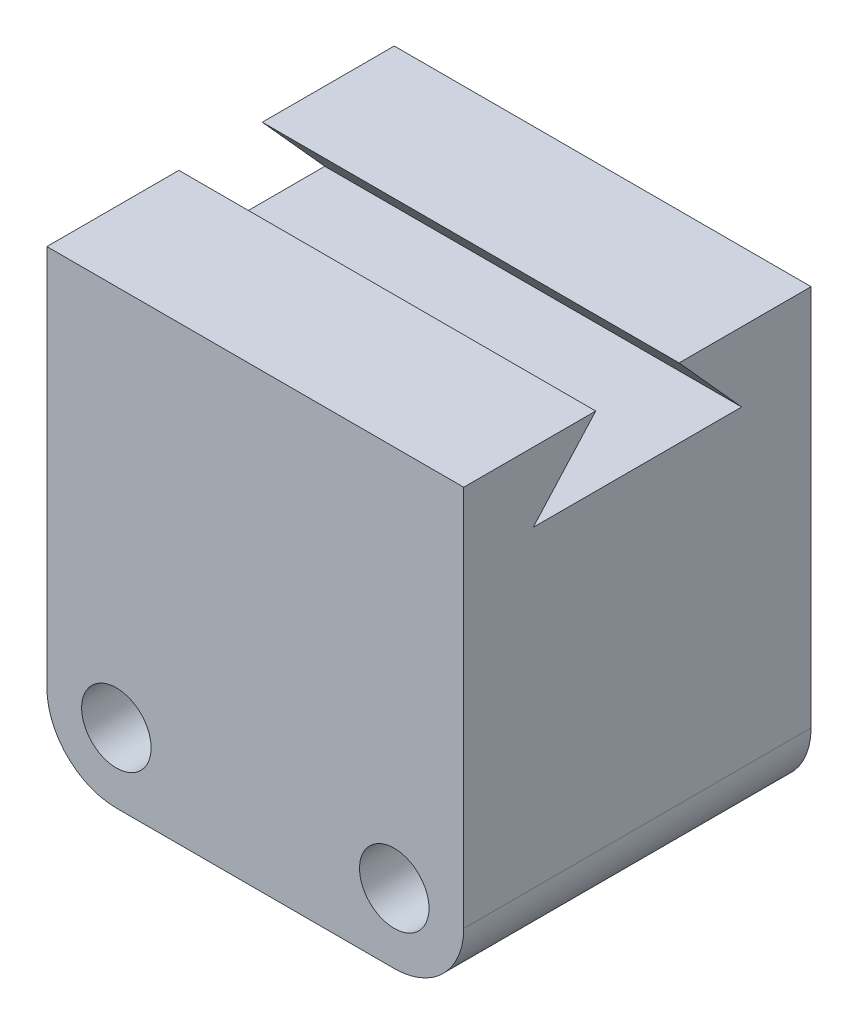
ISO-10303-21;
HEADER;
FILE_DESCRIPTION(('STEP AP214'),'2;1');
FILE_NAME('part.step','',(''),(''),'','','');
FILE_SCHEMA(('AUTOMOTIVE_DESIGN { 1 0 10303 214 1 1 1 1 }'));
ENDSEC;
DATA;
#1=APPLICATION_CONTEXT('core data for automotive mechanical design processes');
#2=APPLICATION_PROTOCOL_DEFINITION('international standard','automotive_design',2000,#1);
#3=PRODUCT_CONTEXT('',#1,'mechanical');
#4=PRODUCT('Part','Part','',(#3));
#5=PRODUCT_RELATED_PRODUCT_CATEGORY('part','',(#4));
#6=PRODUCT_DEFINITION_FORMATION('','',#4);
#7=PRODUCT_DEFINITION_CONTEXT('part definition',#1,'design');
#8=PRODUCT_DEFINITION('design','',#6,#7);
#9=PRODUCT_DEFINITION_SHAPE('','',#8);
#10=(LENGTH_UNIT() NAMED_UNIT(*) SI_UNIT(.MILLI.,.METRE.));
#11=(NAMED_UNIT(*) PLANE_ANGLE_UNIT() SI_UNIT($,.RADIAN.));
#12=(NAMED_UNIT(*) SI_UNIT($,.STERADIAN.) SOLID_ANGLE_UNIT());
#13=UNCERTAINTY_MEASURE_WITH_UNIT(LENGTH_MEASURE(1.E-05),#10,'distance_accuracy_value','');
#14=(GEOMETRIC_REPRESENTATION_CONTEXT(3) GLOBAL_UNCERTAINTY_ASSIGNED_CONTEXT((#13)) GLOBAL_UNIT_ASSIGNED_CONTEXT((#10,
#11,#12)) REPRESENTATION_CONTEXT('',''));
#15=CARTESIAN_POINT('',(0.,0.,0.));
#16=DIRECTION('',(0.,0.,1.));
#17=DIRECTION('',(1.,0.,0.));
#18=AXIS2_PLACEMENT_3D('',#15,#16,#17);
#19=CARTESIAN_POINT('',(-12.5782589593847,-7.83943175827022,7.5));
#20=DIRECTION('',(0.,-1.,0.));
#21=DIRECTION('',(0.,0.,-1.));
#22=AXIS2_PLACEMENT_3D('',#19,#20,#21);
#23=PLANE('',#22);
#24=DIRECTION('',(0.,0.,-1.));
#25=VECTOR('',#24,1.);
#26=CARTESIAN_POINT('',(5.42174104061526,-7.83943175827022,7.5));
#27=LINE('',#26,#25);
#28=CARTESIAN_POINT('',(5.42174104061526,-7.83943175827022,7.5));
#29=VERTEX_POINT('',#28);
#30=CARTESIAN_POINT('',(5.42174104061526,-7.83943175827022,1.8));
#31=VERTEX_POINT('',#30);
#32=EDGE_CURVE('E203',#29,#31,#27,.T.);
#33=ORIENTED_EDGE('',*,*,#32,.T.);
#34=DIRECTION('',(1.,0.,0.));
#35=VECTOR('',#34,1.);
#36=CARTESIAN_POINT('',(-22.0650919398899,-7.83943175827023,1.8));
#37=LINE('',#36,#35);
#38=CARTESIAN_POINT('',(-12.5782589593847,-7.83943175827023,1.8));
#39=VERTEX_POINT('',#38);
#40=EDGE_CURVE('E144',#39,#31,#37,.T.);
#41=ORIENTED_EDGE('',*,*,#40,.F.);
#42=DIRECTION('',(0.,0.,-1.));
#43=VECTOR('',#42,1.);
#44=CARTESIAN_POINT('',(-12.5782589593847,-7.83943175827022,7.5));
#45=LINE('',#44,#43);
#46=CARTESIAN_POINT('',(-12.5782589593847,-7.83943175827022,7.5));
#47=VERTEX_POINT('',#46);
#48=EDGE_CURVE('E198',#47,#39,#45,.T.);
#49=ORIENTED_EDGE('',*,*,#48,.F.);
#50=DIRECTION('',(-1.,0.,0.));
#51=VECTOR('',#50,1.);
#52=CARTESIAN_POINT('',(-12.5782589593847,-7.83943175827022,7.5));
#53=LINE('',#52,#51);
#54=EDGE_CURVE('E182',#29,#47,#53,.T.);
#55=ORIENTED_EDGE('',*,*,#54,.F.);
#56=EDGE_LOOP('',(#33,#41,#49,#55));
#57=FACE_BOUND('',#56,.T.);
#58=ADVANCED_FACE('F44',(#57),#23,.F.);
#59=CARTESIAN_POINT('',(-12.5782589593847,-7.83943175827022,7.5));
#60=DIRECTION('',(1.,0.,0.));
#61=DIRECTION('',(0.,1.,0.));
#62=AXIS2_PLACEMENT_3D('',#59,#60,#61);
#63=PLANE('',#62);
#64=DIRECTION('',(0.,-1.,0.));
#65=VECTOR('',#64,1.);
#66=CARTESIAN_POINT('',(-12.5782589593847,-7.83943175827022,-7.5));
#67=LINE('',#66,#65);
#68=CARTESIAN_POINT('',(-12.5782589593847,-7.83943175827022,-7.5));
#69=VERTEX_POINT('',#68);
#70=CARTESIAN_POINT('',(-12.5782589593847,-24.3394317582702,-7.5));
#71=VERTEX_POINT('',#70);
#72=EDGE_CURVE('E170',#69,#71,#67,.T.);
#73=ORIENTED_EDGE('',*,*,#72,.T.);
#74=DIRECTION('',(0.,0.,-1.));
#75=VECTOR('',#74,1.);
#76=CARTESIAN_POINT('',(-12.5782589593847,-24.3394317582702,7.5));
#77=LINE('',#76,#75);
#78=CARTESIAN_POINT('',(-12.5782589593847,-24.3394317582702,7.5));
#79=VERTEX_POINT('',#78);
#80=EDGE_CURVE('E68',#71,#79,#77,.F.);
#81=ORIENTED_EDGE('',*,*,#80,.T.);
#82=DIRECTION('',(0.,-1.,0.));
#83=VECTOR('',#82,1.);
#84=CARTESIAN_POINT('',(-12.5782589593847,-7.83943175827022,7.5));
#85=LINE('',#84,#83);
#86=EDGE_CURVE('E172',#47,#79,#85,.T.);
#87=ORIENTED_EDGE('',*,*,#86,.F.);
#88=ORIENTED_EDGE('',*,*,#48,.T.);
#89=DIRECTION('',(0.,0.743294146247166,-0.66896473162245));
#90=VECTOR('',#89,1.);
#91=CARTESIAN_POINT('',(-12.5782589593847,-10.8394317582702,4.5));
#92=LINE('',#91,#90);
#93=CARTESIAN_POINT('',(-12.5782589593847,-10.8394317582702,4.5));
#94=VERTEX_POINT('',#93);
#95=EDGE_CURVE('E171',#94,#39,#92,.T.);
#96=ORIENTED_EDGE('',*,*,#95,.F.);
#97=DIRECTION('',(0.,0.,1.));
#98=VECTOR('',#97,1.);
#99=CARTESIAN_POINT('',(-12.5782589593847,-10.8394317582702,4.5));
#100=LINE('',#99,#98);
#101=CARTESIAN_POINT('',(-12.5782589593847,-10.8394317582702,-4.5));
#102=VERTEX_POINT('',#101);
#103=EDGE_CURVE('E133',#102,#94,#100,.T.);
#104=ORIENTED_EDGE('',*,*,#103,.F.);
#105=DIRECTION('',(0.,-0.743294146247166,-0.66896473162245));
#106=VECTOR('',#105,1.);
#107=CARTESIAN_POINT('',(-12.5782589593847,-10.8394317582702,-4.5));
#108=LINE('',#107,#106);
#109=CARTESIAN_POINT('',(-12.5782589593847,-7.83943175827022,-1.8));
#110=VERTEX_POINT('',#109);
#111=EDGE_CURVE('E161',#110,#102,#108,.T.);
#112=ORIENTED_EDGE('',*,*,#111,.F.);
#113=EDGE_CURVE('E185',#110,#69,#45,.T.);
#114=ORIENTED_EDGE('',*,*,#113,.T.);
#115=EDGE_LOOP('',(#73,#81,#87,#88,#96,#104,#112,#114));
#116=FACE_BOUND('',#115,.T.);
#117=ADVANCED_FACE('F237',(#116),#63,.F.);
#118=CARTESIAN_POINT('',(-12.5782589593847,-27.3394317582702,7.5));
#119=DIRECTION('',(0.,1.,0.));
#120=DIRECTION('',(0.,0.,1.));
#121=AXIS2_PLACEMENT_3D('',#118,#119,#120);
#122=PLANE('',#121);
#123=DIRECTION('',(1.,0.,0.));
#124=VECTOR('',#123,1.);
#125=CARTESIAN_POINT('',(-12.5782589593847,-27.3394317582702,7.5));
#126=LINE('',#125,#124);
#127=CARTESIAN_POINT('',(-9.57825895938474,-27.3394317582702,7.5));
#128=VERTEX_POINT('',#127);
#129=CARTESIAN_POINT('',(2.42174104061526,-27.3394317582702,7.5));
#130=VERTEX_POINT('',#129);
#131=EDGE_CURVE('E175',#128,#130,#126,.T.);
#132=ORIENTED_EDGE('',*,*,#131,.F.);
#133=DIRECTION('',(0.,0.,-1.));
#134=VECTOR('',#133,1.);
#135=CARTESIAN_POINT('',(-9.57825895938474,-27.3394317582702,7.5));
#136=LINE('',#135,#134);
#137=CARTESIAN_POINT('',(-9.57825895938474,-27.3394317582702,-7.5));
#138=VERTEX_POINT('',#137);
#139=EDGE_CURVE('E209',#128,#138,#136,.T.);
#140=ORIENTED_EDGE('',*,*,#139,.T.);
#141=DIRECTION('',(1.,0.,0.));
#142=VECTOR('',#141,1.);
#143=CARTESIAN_POINT('',(-12.5782589593847,-27.3394317582702,-7.5));
#144=LINE('',#143,#142);
#145=CARTESIAN_POINT('',(2.42174104061526,-27.3394317582702,-7.5));
#146=VERTEX_POINT('',#145);
#147=EDGE_CURVE('E188',#138,#146,#144,.T.);
#148=ORIENTED_EDGE('',*,*,#147,.T.);
#149=DIRECTION('',(0.,0.,-1.));
#150=VECTOR('',#149,1.);
#151=CARTESIAN_POINT('',(2.42174104061526,-27.3394317582702,7.5));
#152=LINE('',#151,#150);
#153=EDGE_CURVE('E206',#146,#130,#152,.F.);
#154=ORIENTED_EDGE('',*,*,#153,.T.);
#155=EDGE_LOOP('',(#132,#140,#148,#154));
#156=FACE_BOUND('',#155,.T.);
#157=ADVANCED_FACE('F229',(#156),#122,.F.);
#158=CARTESIAN_POINT('',(5.42174104061526,-7.83943175827022,7.5));
#159=DIRECTION('',(-1.,0.,0.));
#160=DIRECTION('',(0.,-1.,0.));
#161=AXIS2_PLACEMENT_3D('',#158,#159,#160);
#162=PLANE('',#161);
#163=DIRECTION('',(0.,1.,0.));
#164=VECTOR('',#163,1.);
#165=CARTESIAN_POINT('',(5.42174104061526,-7.83943175827022,7.5));
#166=LINE('',#165,#164);
#167=CARTESIAN_POINT('',(5.42174104061526,-24.3394317582702,7.5));
#168=VERTEX_POINT('',#167);
#169=EDGE_CURVE('E179',#168,#29,#166,.T.);
#170=ORIENTED_EDGE('',*,*,#169,.F.);
#171=DIRECTION('',(0.,0.,-1.));
#172=VECTOR('',#171,1.);
#173=CARTESIAN_POINT('',(5.42174104061526,-24.3394317582702,7.5));
#174=LINE('',#173,#172);
#175=CARTESIAN_POINT('',(5.42174104061526,-24.3394317582702,-7.5));
#176=VERTEX_POINT('',#175);
#177=EDGE_CURVE('E11',#168,#176,#174,.T.);
#178=ORIENTED_EDGE('',*,*,#177,.T.);
#179=DIRECTION('',(0.,1.,0.));
#180=VECTOR('',#179,1.);
#181=CARTESIAN_POINT('',(5.42174104061526,-7.83943175827022,-7.5));
#182=LINE('',#181,#180);
#183=CARTESIAN_POINT('',(5.42174104061526,-7.83943175827022,-7.5));
#184=VERTEX_POINT('',#183);
#185=EDGE_CURVE('E192',#176,#184,#182,.T.);
#186=ORIENTED_EDGE('',*,*,#185,.T.);
#187=CARTESIAN_POINT('',(5.42174104061526,-7.83943175827022,-1.8));
#188=VERTEX_POINT('',#187);
#189=EDGE_CURVE('E202',#188,#184,#27,.T.);
#190=ORIENTED_EDGE('',*,*,#189,.F.);
#191=DIRECTION('',(0.,0.743294146247166,0.66896473162245));
#192=VECTOR('',#191,1.);
#193=CARTESIAN_POINT('',(5.42174104061526,-10.8394317582702,-4.5));
#194=LINE('',#193,#192);
#195=CARTESIAN_POINT('',(5.42174104061526,-10.8394317582702,-4.5));
#196=VERTEX_POINT('',#195);
#197=EDGE_CURVE('E138',#196,#188,#194,.T.);
#198=ORIENTED_EDGE('',*,*,#197,.F.);
#199=DIRECTION('',(0.,0.,-1.));
#200=VECTOR('',#199,1.);
#201=CARTESIAN_POINT('',(5.42174104061526,-10.8394317582702,4.5));
#202=LINE('',#201,#200);
#203=CARTESIAN_POINT('',(5.42174104061526,-10.8394317582702,4.5));
#204=VERTEX_POINT('',#203);
#205=EDGE_CURVE('E130',#204,#196,#202,.T.);
#206=ORIENTED_EDGE('',*,*,#205,.F.);
#207=DIRECTION('',(0.,-0.743294146247166,0.66896473162245));
#208=VECTOR('',#207,1.);
#209=CARTESIAN_POINT('',(5.42174104061526,-10.8394317582702,4.5));
#210=LINE('',#209,#208);
#211=EDGE_CURVE('E141',#31,#204,#210,.T.);
#212=ORIENTED_EDGE('',*,*,#211,.F.);
#213=ORIENTED_EDGE('',*,*,#32,.F.);
#214=EDGE_LOOP('',(#170,#178,#186,#190,#198,#206,#212,#213));
#215=FACE_BOUND('',#214,.T.);
#216=ADVANCED_FACE('F151',(#215),#162,.F.);
#217=ORIENTED_EDGE('',*,*,#113,.F.);
#218=DIRECTION('',(1.,0.,0.));
#219=VECTOR('',#218,1.);
#220=CARTESIAN_POINT('',(-22.0650919398899,-7.83943175827023,-1.8));
#221=LINE('',#220,#219);
#222=EDGE_CURVE('E162',#110,#188,#221,.T.);
#223=ORIENTED_EDGE('',*,*,#222,.T.);
#224=ORIENTED_EDGE('',*,*,#189,.T.);
#225=DIRECTION('',(-1.,0.,0.));
#226=VECTOR('',#225,1.);
#227=CARTESIAN_POINT('',(-12.5782589593847,-7.83943175827022,-7.5));
#228=LINE('',#227,#226);
#229=EDGE_CURVE('E176',#184,#69,#228,.T.);
#230=ORIENTED_EDGE('',*,*,#229,.T.);
#231=EDGE_LOOP('',(#217,#223,#224,#230));
#232=FACE_BOUND('',#231,.T.);
#233=ADVANCED_FACE('F243',(#232),#23,.F.);
#234=CARTESIAN_POINT('',(-2.50478127156932,-12.4293365695363,7.5));
#235=DIRECTION('',(0.,0.,1.));
#236=DIRECTION('',(1.,0.,0.));
#237=AXIS2_PLACEMENT_3D('',#234,#235,#236);
#238=PLANE('',#237);
#239=CARTESIAN_POINT('',(2.42174104061526,-24.3394317582702,7.5));
#240=DIRECTION('',(0.,0.,1.));
#241=DIRECTION('',(1.,0.,0.));
#242=AXIS2_PLACEMENT_3D('',#239,#240,#241);
#243=CIRCLE('',#242,1.5);
#244=CARTESIAN_POINT('',(3.92174104061526,-24.3394317582702,7.5));
#245=VERTEX_POINT('',#244);
#246=EDGE_CURVE('E432',#245,#245,#243,.T.);
#247=ORIENTED_EDGE('',*,*,#246,.F.);
#248=EDGE_LOOP('',(#247));
#249=FACE_BOUND('',#248,.T.);
#250=CARTESIAN_POINT('',(-9.57825895938474,-24.3394317582702,7.5));
#251=DIRECTION('',(0.,0.,1.));
#252=DIRECTION('',(1.,0.,0.));
#253=AXIS2_PLACEMENT_3D('',#250,#251,#252);
#254=CIRCLE('',#253,1.5);
#255=CARTESIAN_POINT('',(-8.07825895938474,-24.3394317582702,7.5));
#256=VERTEX_POINT('',#255);
#257=EDGE_CURVE('E428',#256,#256,#254,.T.);
#258=ORIENTED_EDGE('',*,*,#257,.F.);
#259=EDGE_LOOP('',(#258));
#260=FACE_BOUND('',#259,.T.);
#261=ORIENTED_EDGE('',*,*,#86,.T.);
#262=CARTESIAN_POINT('',(-9.57825895938474,-24.3394317582702,7.5));
#263=DIRECTION('',(0.,0.,1.));
#264=DIRECTION('',(1.,0.,0.));
#265=AXIS2_PLACEMENT_3D('',#262,#263,#264);
#266=CIRCLE('',#265,3.);
#267=EDGE_CURVE('E53',#79,#128,#266,.T.);
#268=ORIENTED_EDGE('',*,*,#267,.T.);
#269=ORIENTED_EDGE('',*,*,#131,.T.);
#270=CARTESIAN_POINT('',(2.42174104061526,-24.3394317582702,7.5));
#271=DIRECTION('',(0.,0.,1.));
#272=DIRECTION('',(1.,0.,0.));
#273=AXIS2_PLACEMENT_3D('',#270,#271,#272);
#274=CIRCLE('',#273,3.);
#275=EDGE_CURVE('E60',#130,#168,#274,.T.);
#276=ORIENTED_EDGE('',*,*,#275,.T.);
#277=ORIENTED_EDGE('',*,*,#169,.T.);
#278=ORIENTED_EDGE('',*,*,#54,.T.);
#279=EDGE_LOOP('',(#261,#268,#269,#276,#277,#278));
#280=FACE_BOUND('',#279,.T.);
#281=ADVANCED_FACE('F225',(#249,#260,#280),#238,.T.);
#282=CARTESIAN_POINT('',(-2.50478127156932,-12.4293365695363,-7.5));
#283=DIRECTION('',(0.,0.,1.));
#284=DIRECTION('',(1.,0.,0.));
#285=AXIS2_PLACEMENT_3D('',#282,#283,#284);
#286=PLANE('',#285);
#287=CARTESIAN_POINT('',(2.42174104061526,-24.3394317582702,-7.5));
#288=DIRECTION('',(0.,0.,1.));
#289=DIRECTION('',(1.,0.,0.));
#290=AXIS2_PLACEMENT_3D('',#287,#288,#289);
#291=CIRCLE('',#290,1.5);
#292=CARTESIAN_POINT('',(3.92174104061526,-24.3394317582702,-7.5));
#293=VERTEX_POINT('',#292);
#294=EDGE_CURVE('E149',#293,#293,#291,.T.);
#295=ORIENTED_EDGE('',*,*,#294,.T.);
#296=EDGE_LOOP('',(#295));
#297=FACE_BOUND('',#296,.T.);
#298=CARTESIAN_POINT('',(-9.57825895938474,-24.3394317582702,-7.5));
#299=DIRECTION('',(0.,0.,1.));
#300=DIRECTION('',(1.,0.,0.));
#301=AXIS2_PLACEMENT_3D('',#298,#299,#300);
#302=CIRCLE('',#301,1.5);
#303=CARTESIAN_POINT('',(-8.07825895938474,-24.3394317582702,-7.5));
#304=VERTEX_POINT('',#303);
#305=EDGE_CURVE('E426',#304,#304,#302,.T.);
#306=ORIENTED_EDGE('',*,*,#305,.T.);
#307=EDGE_LOOP('',(#306));
#308=FACE_BOUND('',#307,.T.);
#309=ORIENTED_EDGE('',*,*,#147,.F.);
#310=CARTESIAN_POINT('',(-9.57825895938474,-24.3394317582702,-7.5));
#311=DIRECTION('',(0.,0.,1.));
#312=DIRECTION('',(1.,0.,0.));
#313=AXIS2_PLACEMENT_3D('',#310,#311,#312);
#314=CIRCLE('',#313,3.);
#315=EDGE_CURVE('E216',#138,#71,#314,.F.);
#316=ORIENTED_EDGE('',*,*,#315,.T.);
#317=ORIENTED_EDGE('',*,*,#72,.F.);
#318=ORIENTED_EDGE('',*,*,#229,.F.);
#319=ORIENTED_EDGE('',*,*,#185,.F.);
#320=CARTESIAN_POINT('',(2.42174104061526,-24.3394317582702,-7.5));
#321=DIRECTION('',(0.,0.,1.));
#322=DIRECTION('',(1.,0.,0.));
#323=AXIS2_PLACEMENT_3D('',#320,#321,#322);
#324=CIRCLE('',#323,3.);
#325=EDGE_CURVE('E213',#176,#146,#324,.F.);
#326=ORIENTED_EDGE('',*,*,#325,.T.);
#327=EDGE_LOOP('',(#309,#316,#317,#318,#319,#326));
#328=FACE_BOUND('',#327,.T.);
#329=ADVANCED_FACE('F235',(#297,#308,#328),#286,.F.);
#330=CARTESIAN_POINT('',(-22.0650919398899,-10.8394317582702,4.5));
#331=DIRECTION('',(0.,0.66896473162245,0.743294146247166));
#332=DIRECTION('',(0.,-0.743294146247166,0.66896473162245));
#333=AXIS2_PLACEMENT_3D('',#330,#331,#332);
#334=PLANE('',#333);
#335=ORIENTED_EDGE('',*,*,#95,.T.);
#336=ORIENTED_EDGE('',*,*,#40,.T.);
#337=ORIENTED_EDGE('',*,*,#211,.T.);
#338=DIRECTION('',(1.,0.,0.));
#339=VECTOR('',#338,1.);
#340=CARTESIAN_POINT('',(-22.0650919398899,-10.8394317582702,4.5));
#341=LINE('',#340,#339);
#342=EDGE_CURVE('E125',#94,#204,#341,.T.);
#343=ORIENTED_EDGE('',*,*,#342,.F.);
#344=EDGE_LOOP('',(#335,#336,#337,#343));
#345=FACE_BOUND('',#344,.T.);
#346=ADVANCED_FACE('F142',(#345),#334,.F.);
#347=CARTESIAN_POINT('',(-22.0650919398899,-10.8394317582702,-4.5));
#348=DIRECTION('',(0.,0.66896473162245,-0.743294146247166));
#349=DIRECTION('',(0.,0.743294146247166,0.66896473162245));
#350=AXIS2_PLACEMENT_3D('',#347,#348,#349);
#351=PLANE('',#350);
#352=ORIENTED_EDGE('',*,*,#111,.T.);
#353=DIRECTION('',(1.,0.,0.));
#354=VECTOR('',#353,1.);
#355=CARTESIAN_POINT('',(-22.0650919398899,-10.8394317582702,-4.5));
#356=LINE('',#355,#354);
#357=EDGE_CURVE('E137',#102,#196,#356,.T.);
#358=ORIENTED_EDGE('',*,*,#357,.T.);
#359=ORIENTED_EDGE('',*,*,#197,.T.);
#360=ORIENTED_EDGE('',*,*,#222,.F.);
#361=EDGE_LOOP('',(#352,#358,#359,#360));
#362=FACE_BOUND('',#361,.T.);
#363=ADVANCED_FACE('F319',(#362),#351,.F.);
#364=CARTESIAN_POINT('',(-22.0650919398899,-10.8394317582702,4.5));
#365=DIRECTION('',(0.,-1.,0.));
#366=DIRECTION('',(1.,0.,0.));
#367=AXIS2_PLACEMENT_3D('',#364,#365,#366);
#368=PLANE('',#367);
#369=ORIENTED_EDGE('',*,*,#103,.T.);
#370=ORIENTED_EDGE('',*,*,#342,.T.);
#371=ORIENTED_EDGE('',*,*,#205,.T.);
#372=ORIENTED_EDGE('',*,*,#357,.F.);
#373=EDGE_LOOP('',(#369,#370,#371,#372));
#374=FACE_BOUND('',#373,.T.);
#375=ADVANCED_FACE('F127',(#374),#368,.F.);
#376=CARTESIAN_POINT('',(-9.57825895938474,-24.3394317582702,-7.5));
#377=DIRECTION('',(0.,0.,1.));
#378=DIRECTION('',(1.,0.,0.));
#379=AXIS2_PLACEMENT_3D('',#376,#377,#378);
#380=CYLINDRICAL_SURFACE('',#379,1.5);
#381=ORIENTED_EDGE('',*,*,#305,.F.);
#382=EDGE_LOOP('',(#381));
#383=FACE_BOUND('',#382,.T.);
#384=ORIENTED_EDGE('',*,*,#257,.T.);
#385=EDGE_LOOP('',(#384));
#386=FACE_BOUND('',#385,.T.);
#387=ADVANCED_FACE('F342',(#383,#386),#380,.F.);
#388=CARTESIAN_POINT('',(2.42174104061526,-24.3394317582702,-7.5));
#389=DIRECTION('',(0.,0.,1.));
#390=DIRECTION('',(1.,0.,0.));
#391=AXIS2_PLACEMENT_3D('',#388,#389,#390);
#392=CYLINDRICAL_SURFACE('',#391,1.5);
#393=ORIENTED_EDGE('',*,*,#294,.F.);
#394=EDGE_LOOP('',(#393));
#395=FACE_BOUND('',#394,.T.);
#396=ORIENTED_EDGE('',*,*,#246,.T.);
#397=EDGE_LOOP('',(#396));
#398=FACE_BOUND('',#397,.T.);
#399=ADVANCED_FACE('F251',(#395,#398),#392,.F.);
#400=CARTESIAN_POINT('',(-9.57825895938474,-24.3394317582702,7.5));
#401=DIRECTION('',(0.,0.,-1.));
#402=DIRECTION('',(-1.,0.,0.));
#403=AXIS2_PLACEMENT_3D('',#400,#401,#402);
#404=CYLINDRICAL_SURFACE('',#403,3.);
#405=ORIENTED_EDGE('',*,*,#267,.F.);
#406=ORIENTED_EDGE('',*,*,#80,.F.);
#407=ORIENTED_EDGE('',*,*,#315,.F.);
#408=ORIENTED_EDGE('',*,*,#139,.F.);
#409=EDGE_LOOP('',(#405,#406,#407,#408));
#410=FACE_BOUND('',#409,.T.);
#411=ADVANCED_FACE('F232',(#410),#404,.T.);
#412=CARTESIAN_POINT('',(2.42174104061526,-24.3394317582702,7.5));
#413=DIRECTION('',(0.,0.,-1.));
#414=DIRECTION('',(-1.,0.,0.));
#415=AXIS2_PLACEMENT_3D('',#412,#413,#414);
#416=CYLINDRICAL_SURFACE('',#415,3.);
#417=ORIENTED_EDGE('',*,*,#275,.F.);
#418=ORIENTED_EDGE('',*,*,#153,.F.);
#419=ORIENTED_EDGE('',*,*,#325,.F.);
#420=ORIENTED_EDGE('',*,*,#177,.F.);
#421=EDGE_LOOP('',(#417,#418,#419,#420));
#422=FACE_BOUND('',#421,.T.);
#423=ADVANCED_FACE('F46',(#422),#416,.T.);
#424=CLOSED_SHELL('',(#58,#117,#157,#216,#233,#281,#329,#346,#363,#375,#387,#399,#411,#423));
#425=MANIFOLD_SOLID_BREP('B2',#424);
#426=ADVANCED_BREP_SHAPE_REPRESENTATION('',(#18,#425),#14);
#427=SHAPE_DEFINITION_REPRESENTATION(#9,#426);
ENDSEC;
END-ISO-10303-21;
